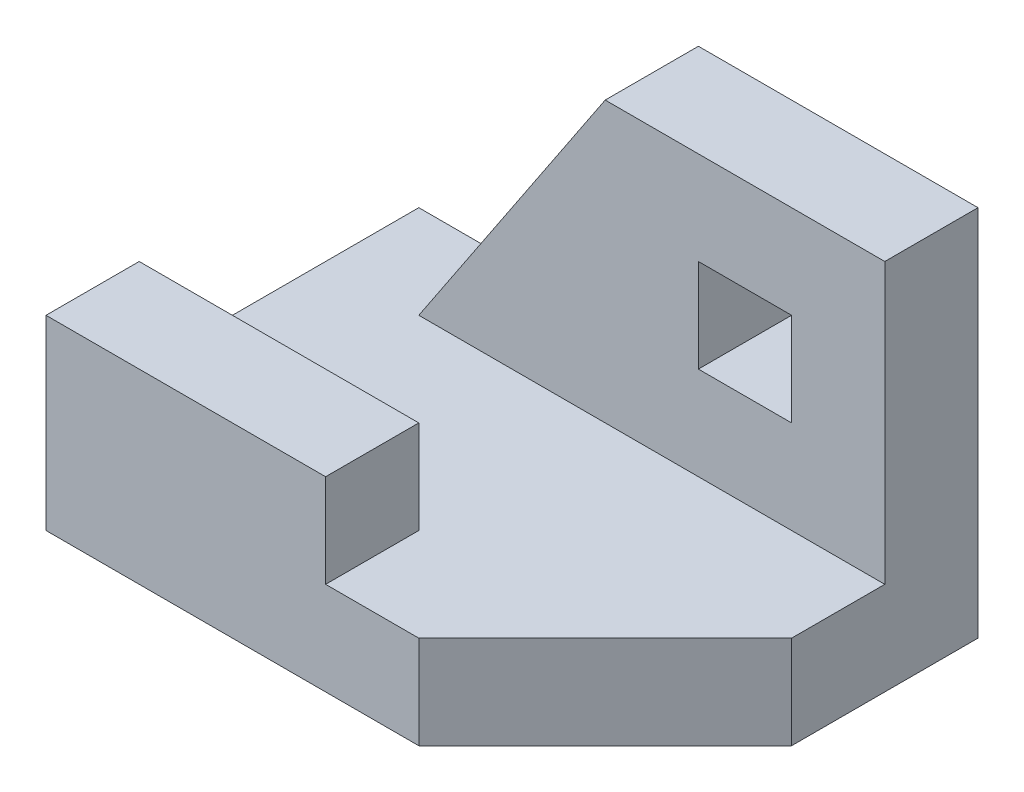
ISO-10303-21;
HEADER;
FILE_DESCRIPTION(('STEP AP214'),'2;1');
FILE_NAME('part.step','',(''),(''),'','','');
FILE_SCHEMA(('AUTOMOTIVE_DESIGN { 1 0 10303 214 1 1 1 1 }'));
ENDSEC;
DATA;
#1=APPLICATION_CONTEXT('core data for automotive mechanical design processes');
#2=APPLICATION_PROTOCOL_DEFINITION('international standard','automotive_design',2000,#1);
#3=PRODUCT_CONTEXT('',#1,'mechanical');
#4=PRODUCT('Part','Part','',(#3));
#5=PRODUCT_RELATED_PRODUCT_CATEGORY('part','',(#4));
#6=PRODUCT_DEFINITION_FORMATION('','',#4);
#7=PRODUCT_DEFINITION_CONTEXT('part definition',#1,'design');
#8=PRODUCT_DEFINITION('design','',#6,#7);
#9=PRODUCT_DEFINITION_SHAPE('','',#8);
#10=(LENGTH_UNIT() NAMED_UNIT(*) SI_UNIT(.MILLI.,.METRE.));
#11=(NAMED_UNIT(*) PLANE_ANGLE_UNIT() SI_UNIT($,.RADIAN.));
#12=(NAMED_UNIT(*) SI_UNIT($,.STERADIAN.) SOLID_ANGLE_UNIT());
#13=UNCERTAINTY_MEASURE_WITH_UNIT(LENGTH_MEASURE(1.E-05),#10,'distance_accuracy_value','');
#14=(GEOMETRIC_REPRESENTATION_CONTEXT(3) GLOBAL_UNCERTAINTY_ASSIGNED_CONTEXT((#13)) GLOBAL_UNIT_ASSIGNED_CONTEXT((#10,
#11,#12)) REPRESENTATION_CONTEXT('',''));
#15=CARTESIAN_POINT('',(0.,0.,0.));
#16=DIRECTION('',(0.,0.,1.));
#17=DIRECTION('',(1.,0.,0.));
#18=AXIS2_PLACEMENT_3D('',#15,#16,#17);
#19=CARTESIAN_POINT('',(0.,5.,0.));
#20=DIRECTION('',(0.,1.,0.));
#21=DIRECTION('',(0.,0.,1.));
#22=AXIS2_PLACEMENT_3D('',#19,#20,#21);
#23=PLANE('',#22);
#24=DIRECTION('',(-1.,0.,0.));
#25=VECTOR('',#24,1.);
#26=CARTESIAN_POINT('',(0.,5.,-15.));
#27=LINE('',#26,#25);
#28=CARTESIAN_POINT('',(30.,5.,-15.));
#29=VERTEX_POINT('',#28);
#30=CARTESIAN_POINT('',(5.,5.,-15.));
#31=VERTEX_POINT('',#30);
#32=EDGE_CURVE('E190',#29,#31,#27,.T.);
#33=ORIENTED_EDGE('',*,*,#32,.T.);
#34=DIRECTION('',(0.,0.,-1.));
#35=VECTOR('',#34,1.);
#36=CARTESIAN_POINT('',(5.,5.,0.));
#37=LINE('',#36,#35);
#38=CARTESIAN_POINT('',(5.,5.,-20.));
#39=VERTEX_POINT('',#38);
#40=EDGE_CURVE('E193',#31,#39,#37,.T.);
#41=ORIENTED_EDGE('',*,*,#40,.T.);
#42=DIRECTION('',(1.,0.,0.));
#43=VECTOR('',#42,1.);
#44=CARTESIAN_POINT('',(0.,5.,-20.));
#45=LINE('',#44,#43);
#46=CARTESIAN_POINT('',(0.,5.,-20.));
#47=VERTEX_POINT('',#46);
#48=EDGE_CURVE('E223',#47,#39,#45,.T.);
#49=ORIENTED_EDGE('',*,*,#48,.F.);
#50=DIRECTION('',(0.,0.,-1.));
#51=VECTOR('',#50,1.);
#52=CARTESIAN_POINT('',(0.,5.,0.));
#53=LINE('',#52,#51);
#54=CARTESIAN_POINT('',(0.,5.,-5.));
#55=VERTEX_POINT('',#54);
#56=EDGE_CURVE('E226',#55,#47,#53,.T.);
#57=ORIENTED_EDGE('',*,*,#56,.F.);
#58=DIRECTION('',(-1.,0.,0.));
#59=VECTOR('',#58,1.);
#60=CARTESIAN_POINT('',(0.,5.,-5.));
#61=LINE('',#60,#59);
#62=CARTESIAN_POINT('',(15.,5.,-5.));
#63=VERTEX_POINT('',#62);
#64=EDGE_CURVE('E216',#63,#55,#61,.T.);
#65=ORIENTED_EDGE('',*,*,#64,.F.);
#66=DIRECTION('',(0.,0.,-1.));
#67=VECTOR('',#66,1.);
#68=CARTESIAN_POINT('',(15.,5.,0.));
#69=LINE('',#68,#67);
#70=CARTESIAN_POINT('',(15.,5.,0.));
#71=VERTEX_POINT('',#70);
#72=EDGE_CURVE('E219',#71,#63,#69,.T.);
#73=ORIENTED_EDGE('',*,*,#72,.F.);
#74=DIRECTION('',(1.,0.,0.));
#75=VECTOR('',#74,1.);
#76=CARTESIAN_POINT('',(0.,5.,0.));
#77=LINE('',#76,#75);
#78=CARTESIAN_POINT('',(20.,5.,0.));
#79=VERTEX_POINT('',#78);
#80=EDGE_CURVE('E229',#71,#79,#77,.T.);
#81=ORIENTED_EDGE('',*,*,#80,.T.);
#82=DIRECTION('',(0.707106781186548,0.,-0.707106781186548));
#83=VECTOR('',#82,1.);
#84=CARTESIAN_POINT('',(10.,5.,10.));
#85=LINE('',#84,#83);
#86=CARTESIAN_POINT('',(30.,5.,-10.));
#87=VERTEX_POINT('',#86);
#88=EDGE_CURVE('E231',#79,#87,#85,.T.);
#89=ORIENTED_EDGE('',*,*,#88,.T.);
#90=DIRECTION('',(0.,0.,-1.));
#91=VECTOR('',#90,1.);
#92=CARTESIAN_POINT('',(30.,5.,0.));
#93=LINE('',#92,#91);
#94=EDGE_CURVE('E233',#87,#29,#93,.T.);
#95=ORIENTED_EDGE('',*,*,#94,.T.);
#96=EDGE_LOOP('',(#33,#41,#49,#57,#65,#73,#81,#89,#95));
#97=FACE_BOUND('',#96,.T.);
#98=ADVANCED_FACE('F35',(#97),#23,.T.);
#99=CARTESIAN_POINT('',(0.,5.,-20.));
#100=DIRECTION('',(0.,0.,-1.));
#101=DIRECTION('',(-1.,0.,0.));
#102=AXIS2_PLACEMENT_3D('',#99,#100,#101);
#103=PLANE('',#102);
#104=DIRECTION('',(0.,-1.,0.));
#105=VECTOR('',#104,1.);
#106=CARTESIAN_POINT('',(25.,5.,-20.));
#107=LINE('',#106,#105);
#108=CARTESIAN_POINT('',(25.,15.,-20.));
#109=VERTEX_POINT('',#108);
#110=CARTESIAN_POINT('',(25.,10.,-20.));
#111=VERTEX_POINT('',#110);
#112=EDGE_CURVE('E178',#109,#111,#107,.T.);
#113=ORIENTED_EDGE('',*,*,#112,.F.);
#114=DIRECTION('',(1.,0.,0.));
#115=VECTOR('',#114,1.);
#116=CARTESIAN_POINT('',(0.,15.,-20.));
#117=LINE('',#116,#115);
#118=CARTESIAN_POINT('',(20.,15.,-20.));
#119=VERTEX_POINT('',#118);
#120=EDGE_CURVE('E173',#119,#109,#117,.T.);
#121=ORIENTED_EDGE('',*,*,#120,.F.);
#122=DIRECTION('',(0.,1.,0.));
#123=VECTOR('',#122,1.);
#124=CARTESIAN_POINT('',(20.,5.,-20.));
#125=LINE('',#124,#123);
#126=CARTESIAN_POINT('',(20.,10.,-20.));
#127=VERTEX_POINT('',#126);
#128=EDGE_CURVE('E147',#127,#119,#125,.T.);
#129=ORIENTED_EDGE('',*,*,#128,.F.);
#130=DIRECTION('',(-1.,0.,0.));
#131=VECTOR('',#130,1.);
#132=CARTESIAN_POINT('',(0.,10.,-20.));
#133=LINE('',#132,#131);
#134=EDGE_CURVE('E176',#111,#127,#133,.T.);
#135=ORIENTED_EDGE('',*,*,#134,.F.);
#136=EDGE_LOOP('',(#113,#121,#129,#135));
#137=FACE_BOUND('',#136,.T.);
#138=DIRECTION('',(-0.554700196225229,-0.832050294337844,0.));
#139=VECTOR('',#138,1.);
#140=CARTESIAN_POINT('',(3.46153846153846,2.69230769230769,-20.));
#141=LINE('',#140,#139);
#142=CARTESIAN_POINT('',(15.,20.,-20.));
#143=VERTEX_POINT('',#142);
#144=EDGE_CURVE('E167',#143,#39,#141,.T.);
#145=ORIENTED_EDGE('',*,*,#144,.F.);
#146=DIRECTION('',(1.,0.,0.));
#147=VECTOR('',#146,1.);
#148=CARTESIAN_POINT('',(0.,20.,-20.));
#149=LINE('',#148,#147);
#150=CARTESIAN_POINT('',(30.,20.,-20.));
#151=VERTEX_POINT('',#150);
#152=EDGE_CURVE('E185',#143,#151,#149,.T.);
#153=ORIENTED_EDGE('',*,*,#152,.T.);
#154=DIRECTION('',(0.,-1.,0.));
#155=VECTOR('',#154,1.);
#156=CARTESIAN_POINT('',(30.,5.,-20.));
#157=LINE('',#156,#155);
#158=CARTESIAN_POINT('',(30.,0.,-20.));
#159=VERTEX_POINT('',#158);
#160=EDGE_CURVE('E236',#151,#159,#157,.T.);
#161=ORIENTED_EDGE('',*,*,#160,.T.);
#162=DIRECTION('',(1.,0.,0.));
#163=VECTOR('',#162,1.);
#164=CARTESIAN_POINT('',(0.,0.,-20.));
#165=LINE('',#164,#163);
#166=CARTESIAN_POINT('',(0.,0.,-20.));
#167=VERTEX_POINT('',#166);
#168=EDGE_CURVE('E222',#167,#159,#165,.T.);
#169=ORIENTED_EDGE('',*,*,#168,.F.);
#170=DIRECTION('',(0.,-1.,0.));
#171=VECTOR('',#170,1.);
#172=CARTESIAN_POINT('',(0.,5.,-20.));
#173=LINE('',#172,#171);
#174=EDGE_CURVE('E43',#47,#167,#173,.T.);
#175=ORIENTED_EDGE('',*,*,#174,.F.);
#176=ORIENTED_EDGE('',*,*,#48,.T.);
#177=EDGE_LOOP('',(#145,#153,#161,#169,#175,#176));
#178=FACE_BOUND('',#177,.T.);
#179=ADVANCED_FACE('F37',(#137,#178),#103,.T.);
#180=CARTESIAN_POINT('',(0.,5.,0.));
#181=DIRECTION('',(-1.,0.,0.));
#182=DIRECTION('',(0.,0.,1.));
#183=AXIS2_PLACEMENT_3D('',#180,#181,#182);
#184=PLANE('',#183);
#185=ORIENTED_EDGE('',*,*,#174,.T.);
#186=DIRECTION('',(0.,0.,-1.));
#187=VECTOR('',#186,1.);
#188=CARTESIAN_POINT('',(0.,0.,0.));
#189=LINE('',#188,#187);
#190=CARTESIAN_POINT('',(0.,0.,0.));
#191=VERTEX_POINT('',#190);
#192=EDGE_CURVE('E239',#191,#167,#189,.T.);
#193=ORIENTED_EDGE('',*,*,#192,.F.);
#194=DIRECTION('',(0.,-1.,0.));
#195=VECTOR('',#194,1.);
#196=CARTESIAN_POINT('',(0.,5.,0.));
#197=LINE('',#196,#195);
#198=CARTESIAN_POINT('',(0.,10.,0.));
#199=VERTEX_POINT('',#198);
#200=EDGE_CURVE('E254',#199,#191,#197,.T.);
#201=ORIENTED_EDGE('',*,*,#200,.F.);
#202=DIRECTION('',(0.,0.,-1.));
#203=VECTOR('',#202,1.);
#204=CARTESIAN_POINT('',(0.,10.,0.));
#205=LINE('',#204,#203);
#206=CARTESIAN_POINT('',(0.,10.,-5.));
#207=VERTEX_POINT('',#206);
#208=EDGE_CURVE('E202',#199,#207,#205,.T.);
#209=ORIENTED_EDGE('',*,*,#208,.T.);
#210=DIRECTION('',(0.,-1.,0.));
#211=VECTOR('',#210,1.);
#212=CARTESIAN_POINT('',(0.,10.,-5.));
#213=LINE('',#212,#211);
#214=EDGE_CURVE('E210',#207,#55,#213,.T.);
#215=ORIENTED_EDGE('',*,*,#214,.T.);
#216=ORIENTED_EDGE('',*,*,#56,.T.);
#217=EDGE_LOOP('',(#185,#193,#201,#209,#215,#216));
#218=FACE_BOUND('',#217,.T.);
#219=ADVANCED_FACE('F260',(#218),#184,.T.);
#220=CARTESIAN_POINT('',(0.,5.,0.));
#221=DIRECTION('',(0.,0.,-1.));
#222=DIRECTION('',(-1.,0.,0.));
#223=AXIS2_PLACEMENT_3D('',#220,#221,#222);
#224=PLANE('',#223);
#225=ORIENTED_EDGE('',*,*,#80,.F.);
#226=DIRECTION('',(0.,-1.,0.));
#227=VECTOR('',#226,1.);
#228=CARTESIAN_POINT('',(15.,10.,0.));
#229=LINE('',#228,#227);
#230=CARTESIAN_POINT('',(15.,10.,0.));
#231=VERTEX_POINT('',#230);
#232=EDGE_CURVE('E207',#231,#71,#229,.T.);
#233=ORIENTED_EDGE('',*,*,#232,.F.);
#234=DIRECTION('',(1.,0.,0.));
#235=VECTOR('',#234,1.);
#236=CARTESIAN_POINT('',(0.,10.,0.));
#237=LINE('',#236,#235);
#238=EDGE_CURVE('E205',#199,#231,#237,.T.);
#239=ORIENTED_EDGE('',*,*,#238,.F.);
#240=ORIENTED_EDGE('',*,*,#200,.T.);
#241=DIRECTION('',(1.,0.,0.));
#242=VECTOR('',#241,1.);
#243=CARTESIAN_POINT('',(0.,0.,0.));
#244=LINE('',#243,#242);
#245=CARTESIAN_POINT('',(20.,0.,0.));
#246=VERTEX_POINT('',#245);
#247=EDGE_CURVE('E241',#191,#246,#244,.T.);
#248=ORIENTED_EDGE('',*,*,#247,.T.);
#249=DIRECTION('',(0.,-1.,0.));
#250=VECTOR('',#249,1.);
#251=CARTESIAN_POINT('',(20.,5.,0.));
#252=LINE('',#251,#250);
#253=EDGE_CURVE('E251',#79,#246,#252,.T.);
#254=ORIENTED_EDGE('',*,*,#253,.F.);
#255=EDGE_LOOP('',(#225,#233,#239,#240,#248,#254));
#256=FACE_BOUND('',#255,.T.);
#257=ADVANCED_FACE('F272',(#256),#224,.F.);
#258=CARTESIAN_POINT('',(10.,5.,10.));
#259=DIRECTION('',(-0.707106781186548,0.,-0.707106781186548));
#260=DIRECTION('',(-0.707106781186548,0.,0.707106781186548));
#261=AXIS2_PLACEMENT_3D('',#258,#259,#260);
#262=PLANE('',#261);
#263=DIRECTION('',(0.707106781186548,0.,-0.707106781186548));
#264=VECTOR('',#263,1.);
#265=CARTESIAN_POINT('',(10.,0.,10.));
#266=LINE('',#265,#264);
#267=CARTESIAN_POINT('',(30.,0.,-10.));
#268=VERTEX_POINT('',#267);
#269=EDGE_CURVE('E243',#246,#268,#266,.T.);
#270=ORIENTED_EDGE('',*,*,#269,.T.);
#271=DIRECTION('',(0.,-1.,0.));
#272=VECTOR('',#271,1.);
#273=CARTESIAN_POINT('',(30.,5.,-10.));
#274=LINE('',#273,#272);
#275=EDGE_CURVE('E248',#87,#268,#274,.T.);
#276=ORIENTED_EDGE('',*,*,#275,.F.);
#277=ORIENTED_EDGE('',*,*,#88,.F.);
#278=ORIENTED_EDGE('',*,*,#253,.T.);
#279=EDGE_LOOP('',(#270,#276,#277,#278));
#280=FACE_BOUND('',#279,.T.);
#281=ADVANCED_FACE('F276',(#280),#262,.F.);
#282=CARTESIAN_POINT('',(30.,5.,0.));
#283=DIRECTION('',(-1.,0.,0.));
#284=DIRECTION('',(0.,0.,1.));
#285=AXIS2_PLACEMENT_3D('',#282,#283,#284);
#286=PLANE('',#285);
#287=ORIENTED_EDGE('',*,*,#160,.F.);
#288=DIRECTION('',(0.,0.,-1.));
#289=VECTOR('',#288,1.);
#290=CARTESIAN_POINT('',(30.,20.,0.));
#291=LINE('',#290,#289);
#292=CARTESIAN_POINT('',(30.,20.,-15.));
#293=VERTEX_POINT('',#292);
#294=EDGE_CURVE('E182',#293,#151,#291,.T.);
#295=ORIENTED_EDGE('',*,*,#294,.F.);
#296=DIRECTION('',(0.,-1.,0.));
#297=VECTOR('',#296,1.);
#298=CARTESIAN_POINT('',(30.,20.,-15.));
#299=LINE('',#298,#297);
#300=EDGE_CURVE('E187',#293,#29,#299,.T.);
#301=ORIENTED_EDGE('',*,*,#300,.T.);
#302=ORIENTED_EDGE('',*,*,#94,.F.);
#303=ORIENTED_EDGE('',*,*,#275,.T.);
#304=DIRECTION('',(0.,0.,-1.));
#305=VECTOR('',#304,1.);
#306=CARTESIAN_POINT('',(30.,0.,0.));
#307=LINE('',#306,#305);
#308=EDGE_CURVE('E227',#268,#159,#307,.T.);
#309=ORIENTED_EDGE('',*,*,#308,.T.);
#310=EDGE_LOOP('',(#287,#295,#301,#302,#303,#309));
#311=FACE_BOUND('',#310,.T.);
#312=ADVANCED_FACE('F300',(#311),#286,.F.);
#313=CARTESIAN_POINT('',(0.,0.,0.));
#314=DIRECTION('',(0.,1.,0.));
#315=DIRECTION('',(0.,0.,1.));
#316=AXIS2_PLACEMENT_3D('',#313,#314,#315);
#317=PLANE('',#316);
#318=ORIENTED_EDGE('',*,*,#168,.T.);
#319=ORIENTED_EDGE('',*,*,#308,.F.);
#320=ORIENTED_EDGE('',*,*,#269,.F.);
#321=ORIENTED_EDGE('',*,*,#247,.F.);
#322=ORIENTED_EDGE('',*,*,#192,.T.);
#323=EDGE_LOOP('',(#318,#319,#320,#321,#322));
#324=FACE_BOUND('',#323,.T.);
#325=ADVANCED_FACE('F267',(#324),#317,.F.);
#326=CARTESIAN_POINT('',(15.,10.,0.));
#327=DIRECTION('',(1.,0.,0.));
#328=DIRECTION('',(0.,0.,-1.));
#329=AXIS2_PLACEMENT_3D('',#326,#327,#328);
#330=PLANE('',#329);
#331=ORIENTED_EDGE('',*,*,#232,.T.);
#332=ORIENTED_EDGE('',*,*,#72,.T.);
#333=DIRECTION('',(0.,-1.,0.));
#334=VECTOR('',#333,1.);
#335=CARTESIAN_POINT('',(15.,10.,-5.));
#336=LINE('',#335,#334);
#337=CARTESIAN_POINT('',(15.,10.,-5.));
#338=VERTEX_POINT('',#337);
#339=EDGE_CURVE('E213',#338,#63,#336,.T.);
#340=ORIENTED_EDGE('',*,*,#339,.F.);
#341=DIRECTION('',(0.,0.,1.));
#342=VECTOR('',#341,1.);
#343=CARTESIAN_POINT('',(15.,10.,0.));
#344=LINE('',#343,#342);
#345=EDGE_CURVE('E196',#338,#231,#344,.T.);
#346=ORIENTED_EDGE('',*,*,#345,.T.);
#347=EDGE_LOOP('',(#331,#332,#340,#346));
#348=FACE_BOUND('',#347,.T.);
#349=ADVANCED_FACE('F285',(#348),#330,.T.);
#350=CARTESIAN_POINT('',(0.,10.,-5.));
#351=DIRECTION('',(0.,0.,-1.));
#352=DIRECTION('',(-1.,0.,0.));
#353=AXIS2_PLACEMENT_3D('',#350,#351,#352);
#354=PLANE('',#353);
#355=ORIENTED_EDGE('',*,*,#339,.T.);
#356=ORIENTED_EDGE('',*,*,#64,.T.);
#357=ORIENTED_EDGE('',*,*,#214,.F.);
#358=DIRECTION('',(1.,0.,0.));
#359=VECTOR('',#358,1.);
#360=CARTESIAN_POINT('',(0.,10.,-5.));
#361=LINE('',#360,#359);
#362=EDGE_CURVE('E199',#207,#338,#361,.T.);
#363=ORIENTED_EDGE('',*,*,#362,.T.);
#364=EDGE_LOOP('',(#355,#356,#357,#363));
#365=FACE_BOUND('',#364,.T.);
#366=ADVANCED_FACE('F290',(#365),#354,.T.);
#367=CARTESIAN_POINT('',(0.,10.,0.));
#368=DIRECTION('',(0.,1.,0.));
#369=DIRECTION('',(0.,0.,1.));
#370=AXIS2_PLACEMENT_3D('',#367,#368,#369);
#371=PLANE('',#370);
#372=ORIENTED_EDGE('',*,*,#345,.F.);
#373=ORIENTED_EDGE('',*,*,#362,.F.);
#374=ORIENTED_EDGE('',*,*,#208,.F.);
#375=ORIENTED_EDGE('',*,*,#238,.T.);
#376=EDGE_LOOP('',(#372,#373,#374,#375));
#377=FACE_BOUND('',#376,.T.);
#378=ADVANCED_FACE('F288',(#377),#371,.T.);
#379=CARTESIAN_POINT('',(0.,20.,-15.));
#380=DIRECTION('',(0.,0.,-1.));
#381=DIRECTION('',(-1.,0.,0.));
#382=AXIS2_PLACEMENT_3D('',#379,#380,#381);
#383=PLANE('',#382);
#384=DIRECTION('',(-1.,0.,0.));
#385=VECTOR('',#384,1.);
#386=CARTESIAN_POINT('',(20.,15.,-15.));
#387=LINE('',#386,#385);
#388=CARTESIAN_POINT('',(25.,15.,-15.));
#389=VERTEX_POINT('',#388);
#390=CARTESIAN_POINT('',(20.,15.,-15.));
#391=VERTEX_POINT('',#390);
#392=EDGE_CURVE('E153',#389,#391,#387,.T.);
#393=ORIENTED_EDGE('',*,*,#392,.F.);
#394=DIRECTION('',(0.,1.,0.));
#395=VECTOR('',#394,1.);
#396=CARTESIAN_POINT('',(25.,10.,-15.));
#397=LINE('',#396,#395);
#398=CARTESIAN_POINT('',(25.,10.,-15.));
#399=VERTEX_POINT('',#398);
#400=EDGE_CURVE('E58',#399,#389,#397,.T.);
#401=ORIENTED_EDGE('',*,*,#400,.F.);
#402=DIRECTION('',(1.,0.,0.));
#403=VECTOR('',#402,1.);
#404=CARTESIAN_POINT('',(20.,10.,-15.));
#405=LINE('',#404,#403);
#406=CARTESIAN_POINT('',(20.,10.,-15.));
#407=VERTEX_POINT('',#406);
#408=EDGE_CURVE('E160',#407,#399,#405,.T.);
#409=ORIENTED_EDGE('',*,*,#408,.F.);
#410=DIRECTION('',(0.,-1.,0.));
#411=VECTOR('',#410,1.);
#412=CARTESIAN_POINT('',(20.,10.,-15.));
#413=LINE('',#412,#411);
#414=EDGE_CURVE('E144',#391,#407,#413,.T.);
#415=ORIENTED_EDGE('',*,*,#414,.F.);
#416=EDGE_LOOP('',(#393,#401,#409,#415));
#417=FACE_BOUND('',#416,.T.);
#418=DIRECTION('',(1.,0.,0.));
#419=VECTOR('',#418,1.);
#420=CARTESIAN_POINT('',(0.,20.,-15.));
#421=LINE('',#420,#419);
#422=CARTESIAN_POINT('',(15.,20.,-15.));
#423=VERTEX_POINT('',#422);
#424=EDGE_CURVE('E180',#423,#293,#421,.T.);
#425=ORIENTED_EDGE('',*,*,#424,.F.);
#426=DIRECTION('',(0.554700196225229,0.832050294337844,0.));
#427=VECTOR('',#426,1.);
#428=CARTESIAN_POINT('',(15.,20.,-15.));
#429=LINE('',#428,#427);
#430=EDGE_CURVE('E170',#31,#423,#429,.T.);
#431=ORIENTED_EDGE('',*,*,#430,.F.);
#432=ORIENTED_EDGE('',*,*,#32,.F.);
#433=ORIENTED_EDGE('',*,*,#300,.F.);
#434=EDGE_LOOP('',(#425,#431,#432,#433));
#435=FACE_BOUND('',#434,.T.);
#436=ADVANCED_FACE('F157',(#417,#435),#383,.F.);
#437=CARTESIAN_POINT('',(0.,20.,0.));
#438=DIRECTION('',(0.,1.,0.));
#439=DIRECTION('',(0.,0.,1.));
#440=AXIS2_PLACEMENT_3D('',#437,#438,#439);
#441=PLANE('',#440);
#442=DIRECTION('',(0.,0.,-1.));
#443=VECTOR('',#442,1.);
#444=CARTESIAN_POINT('',(15.,20.,0.));
#445=LINE('',#444,#443);
#446=EDGE_CURVE('E11',#423,#143,#445,.T.);
#447=ORIENTED_EDGE('',*,*,#446,.F.);
#448=ORIENTED_EDGE('',*,*,#424,.T.);
#449=ORIENTED_EDGE('',*,*,#294,.T.);
#450=ORIENTED_EDGE('',*,*,#152,.F.);
#451=EDGE_LOOP('',(#447,#448,#449,#450));
#452=FACE_BOUND('',#451,.T.);
#453=ADVANCED_FACE('F295',(#452),#441,.T.);
#454=CARTESIAN_POINT('',(15.,20.,-35.));
#455=DIRECTION('',(0.832050294337844,-0.554700196225229,0.));
#456=DIRECTION('',(0.554700196225229,0.832050294337844,0.));
#457=AXIS2_PLACEMENT_3D('',#454,#455,#456);
#458=PLANE('',#457);
#459=ORIENTED_EDGE('',*,*,#144,.T.);
#460=ORIENTED_EDGE('',*,*,#40,.F.);
#461=ORIENTED_EDGE('',*,*,#430,.T.);
#462=ORIENTED_EDGE('',*,*,#446,.T.);
#463=EDGE_LOOP('',(#459,#460,#461,#462));
#464=FACE_BOUND('',#463,.T.);
#465=ADVANCED_FACE('F302',(#464),#458,.F.);
#466=CARTESIAN_POINT('',(25.,10.,-35.));
#467=DIRECTION('',(1.,0.,0.));
#468=DIRECTION('',(0.,0.,-1.));
#469=AXIS2_PLACEMENT_3D('',#466,#467,#468);
#470=PLANE('',#469);
#471=ORIENTED_EDGE('',*,*,#112,.T.);
#472=DIRECTION('',(0.,0.,1.));
#473=VECTOR('',#472,1.);
#474=CARTESIAN_POINT('',(25.,10.,-35.));
#475=LINE('',#474,#473);
#476=EDGE_CURVE('E165',#111,#399,#475,.T.);
#477=ORIENTED_EDGE('',*,*,#476,.T.);
#478=ORIENTED_EDGE('',*,*,#400,.T.);
#479=DIRECTION('',(0.,0.,1.));
#480=VECTOR('',#479,1.);
#481=CARTESIAN_POINT('',(25.,15.,-35.));
#482=LINE('',#481,#480);
#483=EDGE_CURVE('E150',#109,#389,#482,.T.);
#484=ORIENTED_EDGE('',*,*,#483,.F.);
#485=EDGE_LOOP('',(#471,#477,#478,#484));
#486=FACE_BOUND('',#485,.T.);
#487=ADVANCED_FACE('F304',(#486),#470,.F.);
#488=CARTESIAN_POINT('',(20.,10.,-35.));
#489=DIRECTION('',(0.,-1.,0.));
#490=DIRECTION('',(0.,0.,-1.));
#491=AXIS2_PLACEMENT_3D('',#488,#489,#490);
#492=PLANE('',#491);
#493=ORIENTED_EDGE('',*,*,#134,.T.);
#494=DIRECTION('',(0.,0.,1.));
#495=VECTOR('',#494,1.);
#496=CARTESIAN_POINT('',(20.,10.,-35.));
#497=LINE('',#496,#495);
#498=EDGE_CURVE('E149',#127,#407,#497,.T.);
#499=ORIENTED_EDGE('',*,*,#498,.T.);
#500=ORIENTED_EDGE('',*,*,#408,.T.);
#501=ORIENTED_EDGE('',*,*,#476,.F.);
#502=EDGE_LOOP('',(#493,#499,#500,#501));
#503=FACE_BOUND('',#502,.T.);
#504=ADVANCED_FACE('F310',(#503),#492,.F.);
#505=CARTESIAN_POINT('',(20.,10.,-35.));
#506=DIRECTION('',(-1.,0.,0.));
#507=DIRECTION('',(0.,0.,1.));
#508=AXIS2_PLACEMENT_3D('',#505,#506,#507);
#509=PLANE('',#508);
#510=ORIENTED_EDGE('',*,*,#128,.T.);
#511=DIRECTION('',(0.,0.,1.));
#512=VECTOR('',#511,1.);
#513=CARTESIAN_POINT('',(20.,15.,-35.));
#514=LINE('',#513,#512);
#515=EDGE_CURVE('E50',#119,#391,#514,.T.);
#516=ORIENTED_EDGE('',*,*,#515,.T.);
#517=ORIENTED_EDGE('',*,*,#414,.T.);
#518=ORIENTED_EDGE('',*,*,#498,.F.);
#519=EDGE_LOOP('',(#510,#516,#517,#518));
#520=FACE_BOUND('',#519,.T.);
#521=ADVANCED_FACE('F141',(#520),#509,.F.);
#522=CARTESIAN_POINT('',(20.,15.,-35.));
#523=DIRECTION('',(0.,1.,0.));
#524=DIRECTION('',(0.,0.,1.));
#525=AXIS2_PLACEMENT_3D('',#522,#523,#524);
#526=PLANE('',#525);
#527=ORIENTED_EDGE('',*,*,#120,.T.);
#528=ORIENTED_EDGE('',*,*,#483,.T.);
#529=ORIENTED_EDGE('',*,*,#392,.T.);
#530=ORIENTED_EDGE('',*,*,#515,.F.);
#531=EDGE_LOOP('',(#527,#528,#529,#530));
#532=FACE_BOUND('',#531,.T.);
#533=ADVANCED_FACE('F154',(#532),#526,.F.);
#534=CLOSED_SHELL('',(#98,#179,#219,#257,#281,#312,#325,#349,#366,#378,#436,#453,#465,#487,#504,
#521,#533));
#535=MANIFOLD_SOLID_BREP('B2',#534);
#536=ADVANCED_BREP_SHAPE_REPRESENTATION('',(#18,#535),#14);
#537=SHAPE_DEFINITION_REPRESENTATION(#9,#536);
ENDSEC;
END-ISO-10303-21;
